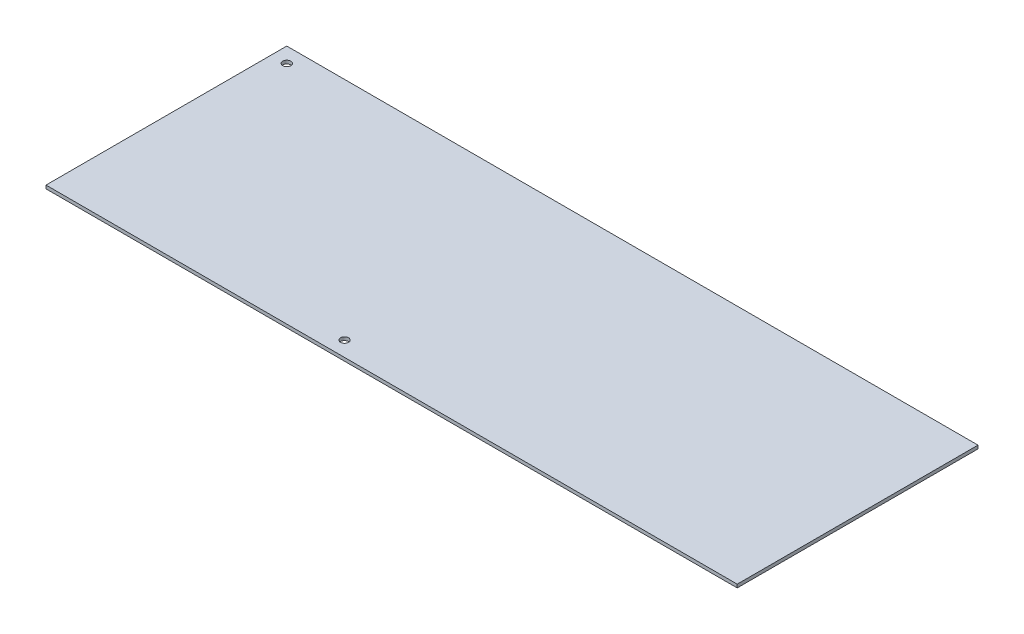
ISO-10303-21;
HEADER;
FILE_DESCRIPTION(('STEP AP214'),'2;1');
FILE_NAME('part.step','',(''),(''),'','','');
FILE_SCHEMA(('AUTOMOTIVE_DESIGN { 1 0 10303 214 1 1 1 1 }'));
ENDSEC;
DATA;
#1=APPLICATION_CONTEXT('core data for automotive mechanical design processes');
#2=APPLICATION_PROTOCOL_DEFINITION('international standard','automotive_design',2000,#1);
#3=PRODUCT_CONTEXT('',#1,'mechanical');
#4=PRODUCT('Part','Part','',(#3));
#5=PRODUCT_RELATED_PRODUCT_CATEGORY('part','',(#4));
#6=PRODUCT_DEFINITION_FORMATION('','',#4);
#7=PRODUCT_DEFINITION_CONTEXT('part definition',#1,'design');
#8=PRODUCT_DEFINITION('design','',#6,#7);
#9=PRODUCT_DEFINITION_SHAPE('','',#8);
#10=(LENGTH_UNIT() NAMED_UNIT(*) SI_UNIT(.MILLI.,.METRE.));
#11=(NAMED_UNIT(*) PLANE_ANGLE_UNIT() SI_UNIT($,.RADIAN.));
#12=(NAMED_UNIT(*) SI_UNIT($,.STERADIAN.) SOLID_ANGLE_UNIT());
#13=UNCERTAINTY_MEASURE_WITH_UNIT(LENGTH_MEASURE(1.E-05),#10,'distance_accuracy_value','');
#14=(GEOMETRIC_REPRESENTATION_CONTEXT(3) GLOBAL_UNCERTAINTY_ASSIGNED_CONTEXT((#13)) GLOBAL_UNIT_ASSIGNED_CONTEXT((#10,
#11,#12)) REPRESENTATION_CONTEXT('',''));
#15=CARTESIAN_POINT('',(0.,0.,0.));
#16=DIRECTION('',(0.,0.,1.));
#17=DIRECTION('',(1.,0.,0.));
#18=AXIS2_PLACEMENT_3D('',#15,#16,#17);
#19=CARTESIAN_POINT('',(0.,1.65,0.));
#20=DIRECTION('',(0.,-1.,0.));
#21=DIRECTION('',(0.,0.,-1.));
#22=AXIS2_PLACEMENT_3D('',#19,#20,#21);
#23=PLANE('',#22);
#24=CARTESIAN_POINT('',(7.50000000000001,1.65,-112.5));
#25=DIRECTION('',(0.,1.,0.));
#26=DIRECTION('',(0.,0.,1.));
#27=AXIS2_PLACEMENT_3D('',#24,#25,#26);
#28=CIRCLE('',#27,2.);
#29=CARTESIAN_POINT('',(7.50000000000001,1.65,-110.5));
#30=VERTEX_POINT('',#29);
#31=EDGE_CURVE('E119',#30,#30,#28,.T.);
#32=ORIENTED_EDGE('',*,*,#31,.F.);
#33=EDGE_LOOP('',(#32));
#34=FACE_BOUND('',#33,.T.);
#35=DIRECTION('',(0.,0.,1.));
#36=VECTOR('',#35,1.);
#37=CARTESIAN_POINT('',(0.,1.65,0.));
#38=LINE('',#37,#36);
#39=CARTESIAN_POINT('',(0.,1.65,-120.));
#40=VERTEX_POINT('',#39);
#41=CARTESIAN_POINT('',(0.,1.65,0.));
#42=VERTEX_POINT('',#41);
#43=EDGE_CURVE('E86',#40,#42,#38,.T.);
#44=ORIENTED_EDGE('',*,*,#43,.T.);
#45=DIRECTION('',(1.,0.,0.));
#46=VECTOR('',#45,1.);
#47=CARTESIAN_POINT('',(0.,1.65,0.));
#48=LINE('',#47,#46);
#49=CARTESIAN_POINT('',(344.4875,1.65,0.));
#50=VERTEX_POINT('',#49);
#51=EDGE_CURVE('E81',#42,#50,#48,.T.);
#52=ORIENTED_EDGE('',*,*,#51,.T.);
#53=DIRECTION('',(0.,0.,-1.));
#54=VECTOR('',#53,1.);
#55=CARTESIAN_POINT('',(344.4875,1.65,0.));
#56=LINE('',#55,#54);
#57=CARTESIAN_POINT('',(344.4875,1.65,-120.));
#58=VERTEX_POINT('',#57);
#59=EDGE_CURVE('E84',#50,#58,#56,.T.);
#60=ORIENTED_EDGE('',*,*,#59,.T.);
#61=DIRECTION('',(-1.,0.,0.));
#62=VECTOR('',#61,1.);
#63=CARTESIAN_POINT('',(0.,1.65,-120.));
#64=LINE('',#63,#62);
#65=EDGE_CURVE('E51',#58,#40,#64,.T.);
#66=ORIENTED_EDGE('',*,*,#65,.T.);
#67=EDGE_LOOP('',(#44,#52,#60,#66));
#68=FACE_BOUND('',#67,.T.);
#69=CARTESIAN_POINT('',(141.2875,1.65,-7.5));
#70=DIRECTION('',(0.,1.,0.));
#71=DIRECTION('',(0.,0.,1.));
#72=AXIS2_PLACEMENT_3D('',#69,#70,#71);
#73=CIRCLE('',#72,2.00000000000002);
#74=CARTESIAN_POINT('',(141.2875,1.65,-5.49999999999998));
#75=VERTEX_POINT('',#74);
#76=EDGE_CURVE('E102',#75,#75,#73,.T.);
#77=ORIENTED_EDGE('',*,*,#76,.F.);
#78=EDGE_LOOP('',(#77));
#79=FACE_BOUND('',#78,.T.);
#80=ADVANCED_FACE('F33',(#34,#68,#79),#23,.F.);
#81=CARTESIAN_POINT('',(0.,0.,0.));
#82=DIRECTION('',(0.,-1.,0.));
#83=DIRECTION('',(0.,0.,-1.));
#84=AXIS2_PLACEMENT_3D('',#81,#82,#83);
#85=PLANE('',#84);
#86=CARTESIAN_POINT('',(7.50000000000001,0.,-112.5));
#87=DIRECTION('',(0.,-1.,0.));
#88=DIRECTION('',(0.,0.,-1.));
#89=AXIS2_PLACEMENT_3D('',#86,#87,#88);
#90=CIRCLE('',#89,2.);
#91=CARTESIAN_POINT('',(7.50000000000001,0.,-114.5));
#92=VERTEX_POINT('',#91);
#93=EDGE_CURVE('E37',#92,#92,#90,.T.);
#94=ORIENTED_EDGE('',*,*,#93,.F.);
#95=EDGE_LOOP('',(#94));
#96=FACE_BOUND('',#95,.T.);
#97=DIRECTION('',(0.,0.,1.));
#98=VECTOR('',#97,1.);
#99=CARTESIAN_POINT('',(0.,0.,0.));
#100=LINE('',#99,#98);
#101=CARTESIAN_POINT('',(0.,0.,-120.));
#102=VERTEX_POINT('',#101);
#103=CARTESIAN_POINT('',(0.,0.,0.));
#104=VERTEX_POINT('',#103);
#105=EDGE_CURVE('E99',#102,#104,#100,.T.);
#106=ORIENTED_EDGE('',*,*,#105,.F.);
#107=DIRECTION('',(-1.,0.,0.));
#108=VECTOR('',#107,1.);
#109=CARTESIAN_POINT('',(0.,0.,-120.));
#110=LINE('',#109,#108);
#111=CARTESIAN_POINT('',(344.4875,0.,-120.));
#112=VERTEX_POINT('',#111);
#113=EDGE_CURVE('E74',#112,#102,#110,.T.);
#114=ORIENTED_EDGE('',*,*,#113,.F.);
#115=DIRECTION('',(0.,0.,-1.));
#116=VECTOR('',#115,1.);
#117=CARTESIAN_POINT('',(344.4875,0.,0.));
#118=LINE('',#117,#116);
#119=CARTESIAN_POINT('',(344.4875,0.,0.));
#120=VERTEX_POINT('',#119);
#121=EDGE_CURVE('E68',#120,#112,#118,.T.);
#122=ORIENTED_EDGE('',*,*,#121,.F.);
#123=DIRECTION('',(1.,0.,0.));
#124=VECTOR('',#123,1.);
#125=CARTESIAN_POINT('',(0.,0.,0.));
#126=LINE('',#125,#124);
#127=EDGE_CURVE('E90',#104,#120,#126,.T.);
#128=ORIENTED_EDGE('',*,*,#127,.F.);
#129=EDGE_LOOP('',(#106,#114,#122,#128));
#130=FACE_BOUND('',#129,.T.);
#131=CARTESIAN_POINT('',(141.2875,0.,-7.5));
#132=DIRECTION('',(0.,1.,0.));
#133=DIRECTION('',(0.,0.,1.));
#134=AXIS2_PLACEMENT_3D('',#131,#132,#133);
#135=CIRCLE('',#134,2.00000000000002);
#136=CARTESIAN_POINT('',(141.2875,0.,-5.49999999999998));
#137=VERTEX_POINT('',#136);
#138=EDGE_CURVE('E114',#137,#137,#135,.T.);
#139=ORIENTED_EDGE('',*,*,#138,.T.);
#140=EDGE_LOOP('',(#139));
#141=FACE_BOUND('',#140,.T.);
#142=ADVANCED_FACE('F110',(#96,#130,#141),#85,.T.);
#143=CARTESIAN_POINT('',(0.,1.65,0.));
#144=DIRECTION('',(1.,0.,0.));
#145=DIRECTION('',(0.,0.,-1.));
#146=AXIS2_PLACEMENT_3D('',#143,#144,#145);
#147=PLANE('',#146);
#148=ORIENTED_EDGE('',*,*,#105,.T.);
#149=DIRECTION('',(0.,-1.,0.));
#150=VECTOR('',#149,1.);
#151=CARTESIAN_POINT('',(0.,1.65,0.));
#152=LINE('',#151,#150);
#153=EDGE_CURVE('E11',#42,#104,#152,.T.);
#154=ORIENTED_EDGE('',*,*,#153,.F.);
#155=ORIENTED_EDGE('',*,*,#43,.F.);
#156=DIRECTION('',(0.,-1.,0.));
#157=VECTOR('',#156,1.);
#158=CARTESIAN_POINT('',(0.,1.65,-120.));
#159=LINE('',#158,#157);
#160=EDGE_CURVE('E95',#40,#102,#159,.T.);
#161=ORIENTED_EDGE('',*,*,#160,.T.);
#162=EDGE_LOOP('',(#148,#154,#155,#161));
#163=FACE_BOUND('',#162,.T.);
#164=ADVANCED_FACE('F35',(#163),#147,.F.);
#165=CARTESIAN_POINT('',(0.,1.65,0.));
#166=DIRECTION('',(0.,0.,-1.));
#167=DIRECTION('',(-1.,0.,0.));
#168=AXIS2_PLACEMENT_3D('',#165,#166,#167);
#169=PLANE('',#168);
#170=ORIENTED_EDGE('',*,*,#127,.T.);
#171=DIRECTION('',(0.,-1.,0.));
#172=VECTOR('',#171,1.);
#173=CARTESIAN_POINT('',(344.4875,1.65,0.));
#174=LINE('',#173,#172);
#175=EDGE_CURVE('E43',#50,#120,#174,.T.);
#176=ORIENTED_EDGE('',*,*,#175,.F.);
#177=ORIENTED_EDGE('',*,*,#51,.F.);
#178=ORIENTED_EDGE('',*,*,#153,.T.);
#179=EDGE_LOOP('',(#170,#176,#177,#178));
#180=FACE_BOUND('',#179,.T.);
#181=ADVANCED_FACE('F89',(#180),#169,.F.);
#182=CARTESIAN_POINT('',(344.4875,1.65,0.));
#183=DIRECTION('',(-1.,0.,0.));
#184=DIRECTION('',(0.,0.,1.));
#185=AXIS2_PLACEMENT_3D('',#182,#183,#184);
#186=PLANE('',#185);
#187=ORIENTED_EDGE('',*,*,#121,.T.);
#188=DIRECTION('',(0.,-1.,0.));
#189=VECTOR('',#188,1.);
#190=CARTESIAN_POINT('',(344.4875,1.65,-120.));
#191=LINE('',#190,#189);
#192=EDGE_CURVE('E91',#58,#112,#191,.T.);
#193=ORIENTED_EDGE('',*,*,#192,.F.);
#194=ORIENTED_EDGE('',*,*,#59,.F.);
#195=ORIENTED_EDGE('',*,*,#175,.T.);
#196=EDGE_LOOP('',(#187,#193,#194,#195));
#197=FACE_BOUND('',#196,.T.);
#198=ADVANCED_FACE('F93',(#197),#186,.F.);
#199=CARTESIAN_POINT('',(0.,1.65,-120.));
#200=DIRECTION('',(0.,0.,1.));
#201=DIRECTION('',(1.,0.,0.));
#202=AXIS2_PLACEMENT_3D('',#199,#200,#201);
#203=PLANE('',#202);
#204=ORIENTED_EDGE('',*,*,#113,.T.);
#205=ORIENTED_EDGE('',*,*,#160,.F.);
#206=ORIENTED_EDGE('',*,*,#65,.F.);
#207=ORIENTED_EDGE('',*,*,#192,.T.);
#208=EDGE_LOOP('',(#204,#205,#206,#207));
#209=FACE_BOUND('',#208,.T.);
#210=ADVANCED_FACE('F107',(#209),#203,.F.);
#211=CARTESIAN_POINT('',(141.2875,1.65,-7.5));
#212=DIRECTION('',(0.,-1.,0.));
#213=DIRECTION('',(0.,0.,-1.));
#214=AXIS2_PLACEMENT_3D('',#211,#212,#213);
#215=CYLINDRICAL_SURFACE('',#214,2.00000000000002);
#216=ORIENTED_EDGE('',*,*,#76,.T.);
#217=EDGE_LOOP('',(#216));
#218=FACE_BOUND('',#217,.T.);
#219=ORIENTED_EDGE('',*,*,#138,.F.);
#220=EDGE_LOOP('',(#219));
#221=FACE_BOUND('',#220,.T.);
#222=ADVANCED_FACE('F140',(#218,#221),#215,.F.);
#223=CARTESIAN_POINT('',(7.50000000000001,-8.35,-112.5));
#224=DIRECTION('',(0.,1.,0.));
#225=DIRECTION('',(0.,0.,1.));
#226=AXIS2_PLACEMENT_3D('',#223,#224,#225);
#227=CYLINDRICAL_SURFACE('',#226,2.);
#228=ORIENTED_EDGE('',*,*,#93,.T.);
#229=EDGE_LOOP('',(#228));
#230=FACE_BOUND('',#229,.T.);
#231=ORIENTED_EDGE('',*,*,#31,.T.);
#232=EDGE_LOOP('',(#231));
#233=FACE_BOUND('',#232,.T.);
#234=ADVANCED_FACE('F126',(#230,#233),#227,.F.);
#235=CLOSED_SHELL('',(#80,#142,#164,#181,#198,#210,#222,#234));
#236=MANIFOLD_SOLID_BREP('B2',#235);
#237=ADVANCED_BREP_SHAPE_REPRESENTATION('',(#18,#236),#14);
#238=SHAPE_DEFINITION_REPRESENTATION(#9,#237);
ENDSEC;
END-ISO-10303-21;
